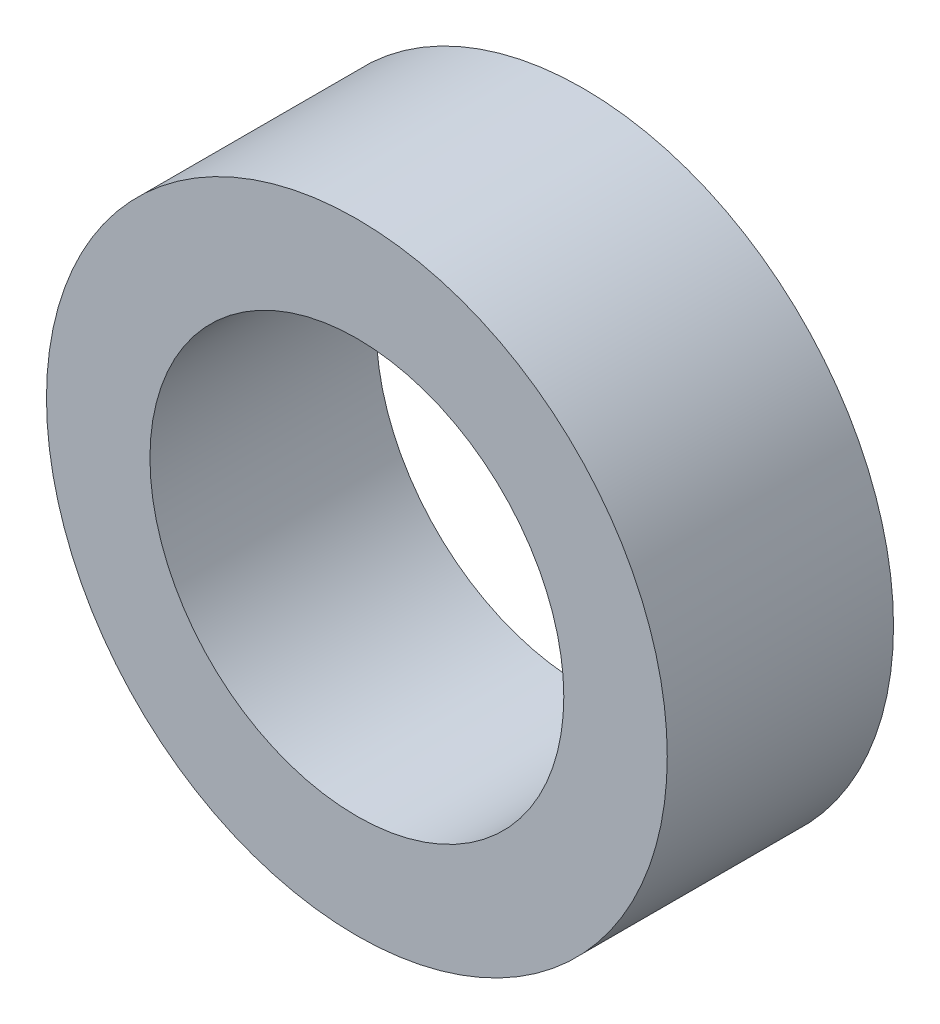
ISO-10303-21;
HEADER;
FILE_DESCRIPTION(('STEP AP214'),'2;1');
FILE_NAME('part.step','',(''),(''),'','','');
FILE_SCHEMA(('AUTOMOTIVE_DESIGN { 1 0 10303 214 1 1 1 1 }'));
ENDSEC;
DATA;
#1=APPLICATION_CONTEXT('core data for automotive mechanical design processes');
#2=APPLICATION_PROTOCOL_DEFINITION('international standard','automotive_design',2000,#1);
#3=PRODUCT_CONTEXT('',#1,'mechanical');
#4=PRODUCT('Part','Part','',(#3));
#5=PRODUCT_RELATED_PRODUCT_CATEGORY('part','',(#4));
#6=PRODUCT_DEFINITION_FORMATION('','',#4);
#7=PRODUCT_DEFINITION_CONTEXT('part definition',#1,'design');
#8=PRODUCT_DEFINITION('design','',#6,#7);
#9=PRODUCT_DEFINITION_SHAPE('','',#8);
#10=(LENGTH_UNIT() NAMED_UNIT(*) SI_UNIT(.MILLI.,.METRE.));
#11=(NAMED_UNIT(*) PLANE_ANGLE_UNIT() SI_UNIT($,.RADIAN.));
#12=(NAMED_UNIT(*) SI_UNIT($,.STERADIAN.) SOLID_ANGLE_UNIT());
#13=UNCERTAINTY_MEASURE_WITH_UNIT(LENGTH_MEASURE(1.E-05),#10,'distance_accuracy_value','');
#14=(GEOMETRIC_REPRESENTATION_CONTEXT(3) GLOBAL_UNCERTAINTY_ASSIGNED_CONTEXT((#13)) GLOBAL_UNIT_ASSIGNED_CONTEXT((#10,
#11,#12)) REPRESENTATION_CONTEXT('',''));
#15=CARTESIAN_POINT('',(0.,0.,0.));
#16=DIRECTION('',(0.,0.,1.));
#17=DIRECTION('',(1.,0.,0.));
#18=AXIS2_PLACEMENT_3D('',#15,#16,#17);
#19=CARTESIAN_POINT('',(-17.7,-16.75,1.64));
#20=DIRECTION('',(0.,0.,1.));
#21=DIRECTION('',(1.,0.,0.));
#22=AXIS2_PLACEMENT_3D('',#19,#20,#21);
#23=PLANE('',#22);
#24=CARTESIAN_POINT('',(-2.5,-2.5,1.64));
#25=DIRECTION('',(0.,0.,1.));
#26=DIRECTION('',(1.,0.,0.));
#27=AXIS2_PLACEMENT_3D('',#24,#25,#26);
#28=CIRCLE('',#27,1.5);
#29=CARTESIAN_POINT('',(-1.,-2.5,1.64));
#30=VERTEX_POINT('',#29);
#31=EDGE_CURVE('E21',#30,#30,#28,.T.);
#32=ORIENTED_EDGE('',*,*,#31,.F.);
#33=EDGE_LOOP('',(#32));
#34=FACE_BOUND('',#33,.T.);
#35=CARTESIAN_POINT('',(-2.5,-2.5,1.64));
#36=DIRECTION('',(0.,0.,1.));
#37=DIRECTION('',(1.,0.,0.));
#38=AXIS2_PLACEMENT_3D('',#35,#36,#37);
#39=CIRCLE('',#38,2.25);
#40=CARTESIAN_POINT('',(-0.25,-2.5,1.64));
#41=VERTEX_POINT('',#40);
#42=EDGE_CURVE('E11',#41,#41,#39,.T.);
#43=ORIENTED_EDGE('',*,*,#42,.T.);
#44=EDGE_LOOP('',(#43));
#45=FACE_BOUND('',#44,.T.);
#46=ADVANCED_FACE('F17',(#34,#45),#23,.T.);
#47=CARTESIAN_POINT('',(-17.7,-16.75,0.));
#48=DIRECTION('',(0.,0.,1.));
#49=DIRECTION('',(1.,0.,0.));
#50=AXIS2_PLACEMENT_3D('',#47,#48,#49);
#51=PLANE('',#50);
#52=CARTESIAN_POINT('',(-2.5,-2.5,0.));
#53=DIRECTION('',(0.,0.,1.));
#54=DIRECTION('',(1.,0.,0.));
#55=AXIS2_PLACEMENT_3D('',#52,#53,#54);
#56=CIRCLE('',#55,1.5);
#57=CARTESIAN_POINT('',(-1.,-2.5,0.));
#58=VERTEX_POINT('',#57);
#59=EDGE_CURVE('E47',#58,#58,#56,.T.);
#60=ORIENTED_EDGE('',*,*,#59,.T.);
#61=EDGE_LOOP('',(#60));
#62=FACE_BOUND('',#61,.T.);
#63=CARTESIAN_POINT('',(-2.5,-2.5,0.));
#64=DIRECTION('',(0.,0.,1.));
#65=DIRECTION('',(1.,0.,0.));
#66=AXIS2_PLACEMENT_3D('',#63,#64,#65);
#67=CIRCLE('',#66,2.25);
#68=CARTESIAN_POINT('',(-0.25,-2.5,0.));
#69=VERTEX_POINT('',#68);
#70=EDGE_CURVE('E28',#69,#69,#67,.T.);
#71=ORIENTED_EDGE('',*,*,#70,.F.);
#72=EDGE_LOOP('',(#71));
#73=FACE_BOUND('',#72,.T.);
#74=ADVANCED_FACE('F71',(#62,#73),#51,.F.);
#75=CARTESIAN_POINT('',(-2.5,-2.5,1.64));
#76=DIRECTION('',(0.,0.,1.));
#77=DIRECTION('',(-1.,0.,0.));
#78=AXIS2_PLACEMENT_3D('',#75,#76,#77);
#79=CYLINDRICAL_SURFACE('',#78,2.25);
#80=ORIENTED_EDGE('',*,*,#42,.F.);
#81=EDGE_LOOP('',(#80));
#82=FACE_BOUND('',#81,.T.);
#83=ORIENTED_EDGE('',*,*,#70,.T.);
#84=EDGE_LOOP('',(#83));
#85=FACE_BOUND('',#84,.T.);
#86=ADVANCED_FACE('F69',(#82,#85),#79,.T.);
#87=CARTESIAN_POINT('',(-2.5,-2.5,1.64));
#88=DIRECTION('',(0.,0.,1.));
#89=DIRECTION('',(-1.,0.,0.));
#90=AXIS2_PLACEMENT_3D('',#87,#88,#89);
#91=CYLINDRICAL_SURFACE('',#90,1.5);
#92=ORIENTED_EDGE('',*,*,#31,.T.);
#93=EDGE_LOOP('',(#92));
#94=FACE_BOUND('',#93,.T.);
#95=ORIENTED_EDGE('',*,*,#59,.F.);
#96=EDGE_LOOP('',(#95));
#97=FACE_BOUND('',#96,.T.);
#98=ADVANCED_FACE('F19',(#94,#97),#91,.F.);
#99=CLOSED_SHELL('',(#46,#74,#86,#98));
#100=MANIFOLD_SOLID_BREP('B1',#99);
#101=ADVANCED_BREP_SHAPE_REPRESENTATION('',(#18,#100),#14);
#102=SHAPE_DEFINITION_REPRESENTATION(#9,#101);
ENDSEC;
END-ISO-10303-21;
